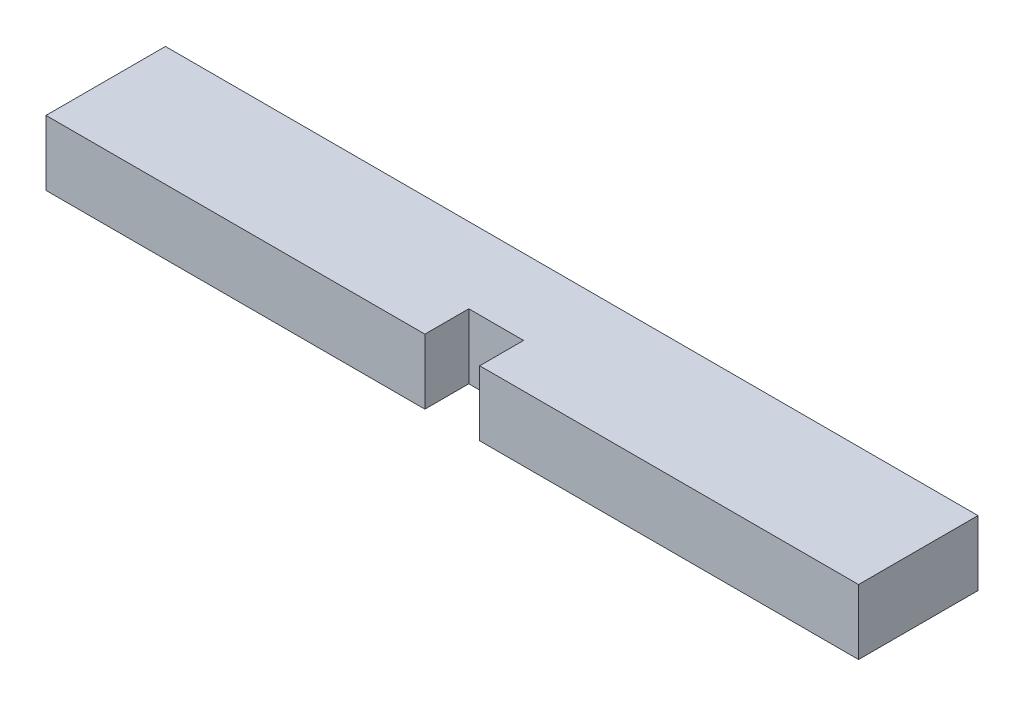
ISO-10303-21;
HEADER;
FILE_DESCRIPTION(('STEP AP214'),'2;1');
FILE_NAME('part.step','',(''),(''),'','','');
FILE_SCHEMA(('AUTOMOTIVE_DESIGN { 1 0 10303 214 1 1 1 1 }'));
ENDSEC;
DATA;
#1=APPLICATION_CONTEXT('core data for automotive mechanical design processes');
#2=APPLICATION_PROTOCOL_DEFINITION('international standard','automotive_design',2000,#1);
#3=PRODUCT_CONTEXT('',#1,'mechanical');
#4=PRODUCT('Part','Part','',(#3));
#5=PRODUCT_RELATED_PRODUCT_CATEGORY('part','',(#4));
#6=PRODUCT_DEFINITION_FORMATION('','',#4);
#7=PRODUCT_DEFINITION_CONTEXT('part definition',#1,'design');
#8=PRODUCT_DEFINITION('design','',#6,#7);
#9=PRODUCT_DEFINITION_SHAPE('','',#8);
#10=(LENGTH_UNIT() NAMED_UNIT(*) SI_UNIT(.MILLI.,.METRE.));
#11=(NAMED_UNIT(*) PLANE_ANGLE_UNIT() SI_UNIT($,.RADIAN.));
#12=(NAMED_UNIT(*) SI_UNIT($,.STERADIAN.) SOLID_ANGLE_UNIT());
#13=UNCERTAINTY_MEASURE_WITH_UNIT(LENGTH_MEASURE(1.E-05),#10,'distance_accuracy_value','');
#14=(GEOMETRIC_REPRESENTATION_CONTEXT(3) GLOBAL_UNCERTAINTY_ASSIGNED_CONTEXT((#13)) GLOBAL_UNIT_ASSIGNED_CONTEXT((#10,
#11,#12)) REPRESENTATION_CONTEXT('',''));
#15=CARTESIAN_POINT('',(0.,0.,0.));
#16=DIRECTION('',(0.,0.,1.));
#17=DIRECTION('',(1.,0.,0.));
#18=AXIS2_PLACEMENT_3D('',#15,#16,#17);
#19=CARTESIAN_POINT('',(-30.2574276062398,4.699,4.63286737044146));
#20=DIRECTION('',(0.,0.,-1.));
#21=DIRECTION('',(-1.,0.,0.));
#22=AXIS2_PLACEMENT_3D('',#19,#20,#21);
#23=PLANE('',#22);
#24=DIRECTION('',(0.,1.,0.));
#25=VECTOR('',#24,1.);
#26=CARTESIAN_POINT('',(1.09887239376018,4.699,4.63286737044146));
#27=LINE('',#26,#25);
#28=CARTESIAN_POINT('',(1.09887239376019,0.,4.63286737044146));
#29=VERTEX_POINT('',#28);
#30=CARTESIAN_POINT('',(1.09887239376019,4.699,4.63286737044146));
#31=VERTEX_POINT('',#30);
#32=EDGE_CURVE('E154',#29,#31,#27,.T.);
#33=ORIENTED_EDGE('',*,*,#32,.F.);
#34=DIRECTION('',(1.,0.,0.));
#35=VECTOR('',#34,1.);
#36=CARTESIAN_POINT('',(-30.2574276062398,0.,4.63286737044146));
#37=LINE('',#36,#35);
#38=CARTESIAN_POINT('',(28.4927723937602,0.,4.63286737044146));
#39=VERTEX_POINT('',#38);
#40=EDGE_CURVE('E141',#29,#39,#37,.T.);
#41=ORIENTED_EDGE('',*,*,#40,.T.);
#42=DIRECTION('',(0.,-1.,0.));
#43=VECTOR('',#42,1.);
#44=CARTESIAN_POINT('',(28.4927723937602,4.699,4.63286737044146));
#45=LINE('',#44,#43);
#46=CARTESIAN_POINT('',(28.4927723937602,4.699,4.63286737044146));
#47=VERTEX_POINT('',#46);
#48=EDGE_CURVE('E169',#47,#39,#45,.T.);
#49=ORIENTED_EDGE('',*,*,#48,.F.);
#50=DIRECTION('',(1.,0.,0.));
#51=VECTOR('',#50,1.);
#52=CARTESIAN_POINT('',(-30.2574276062398,4.699,4.63286737044146));
#53=LINE('',#52,#51);
#54=EDGE_CURVE('E192',#31,#47,#53,.T.);
#55=ORIENTED_EDGE('',*,*,#54,.F.);
#56=EDGE_LOOP('',(#33,#41,#49,#55));
#57=FACE_BOUND('',#56,.T.);
#58=ADVANCED_FACE('F45',(#57),#23,.F.);
#59=DIRECTION('',(0.,-1.,0.));
#60=VECTOR('',#59,1.);
#61=CARTESIAN_POINT('',(-2.86352760623981,4.69899999999999,4.63286737044146));
#62=LINE('',#61,#60);
#63=CARTESIAN_POINT('',(-2.86352760623981,4.699,4.63286737044146));
#64=VERTEX_POINT('',#63);
#65=CARTESIAN_POINT('',(-2.86352760623981,0.,4.63286737044146));
#66=VERTEX_POINT('',#65);
#67=EDGE_CURVE('E177',#64,#66,#62,.T.);
#68=ORIENTED_EDGE('',*,*,#67,.F.);
#69=CARTESIAN_POINT('',(-30.2574276062398,4.699,4.63286737044146));
#70=VERTEX_POINT('',#69);
#71=EDGE_CURVE('E99',#70,#64,#53,.T.);
#72=ORIENTED_EDGE('',*,*,#71,.F.);
#73=DIRECTION('',(0.,-1.,0.));
#74=VECTOR('',#73,1.);
#75=CARTESIAN_POINT('',(-30.2574276062398,4.699,4.63286737044146));
#76=LINE('',#75,#74);
#77=CARTESIAN_POINT('',(-30.2574276062398,0.,4.63286737044146));
#78=VERTEX_POINT('',#77);
#79=EDGE_CURVE('E172',#70,#78,#76,.T.);
#80=ORIENTED_EDGE('',*,*,#79,.T.);
#81=EDGE_CURVE('E147',#78,#66,#37,.T.);
#82=ORIENTED_EDGE('',*,*,#81,.T.);
#83=EDGE_LOOP('',(#68,#72,#80,#82));
#84=FACE_BOUND('',#83,.T.);
#85=ADVANCED_FACE('F179',(#84),#23,.F.);
#86=CARTESIAN_POINT('',(0.,4.699,0.));
#87=DIRECTION('',(0.,1.,0.));
#88=DIRECTION('',(0.,0.,1.));
#89=AXIS2_PLACEMENT_3D('',#86,#87,#88);
#90=PLANE('',#89);
#91=DIRECTION('',(-1.,0.,0.));
#92=VECTOR('',#91,1.);
#93=CARTESIAN_POINT('',(-2.86352760623981,4.699,1.45786737044146));
#94=LINE('',#93,#92);
#95=CARTESIAN_POINT('',(1.09887239376019,4.699,1.45786737044146));
#96=VERTEX_POINT('',#95);
#97=CARTESIAN_POINT('',(-2.86352760623981,4.699,1.45786737044146));
#98=VERTEX_POINT('',#97);
#99=EDGE_CURVE('E129',#96,#98,#94,.T.);
#100=ORIENTED_EDGE('',*,*,#99,.F.);
#101=DIRECTION('',(0.,0.,-1.));
#102=VECTOR('',#101,1.);
#103=CARTESIAN_POINT('',(1.09887239376019,4.699,4.63287937044146));
#104=LINE('',#103,#102);
#105=EDGE_CURVE('E126',#31,#96,#104,.T.);
#106=ORIENTED_EDGE('',*,*,#105,.F.);
#107=ORIENTED_EDGE('',*,*,#54,.T.);
#108=DIRECTION('',(0.,0.,-1.));
#109=VECTOR('',#108,1.);
#110=CARTESIAN_POINT('',(28.4927723937602,4.699,-4.00313262955854));
#111=LINE('',#110,#109);
#112=CARTESIAN_POINT('',(28.4927723937602,4.699,-4.00313262955854));
#113=VERTEX_POINT('',#112);
#114=EDGE_CURVE('E186',#47,#113,#111,.T.);
#115=ORIENTED_EDGE('',*,*,#114,.T.);
#116=DIRECTION('',(-1.,0.,0.));
#117=VECTOR('',#116,1.);
#118=CARTESIAN_POINT('',(-30.2574276062398,4.699,-4.00313262955854));
#119=LINE('',#118,#117);
#120=CARTESIAN_POINT('',(-30.2574276062398,4.699,-4.00313262955854));
#121=VERTEX_POINT('',#120);
#122=EDGE_CURVE('E70',#113,#121,#119,.T.);
#123=ORIENTED_EDGE('',*,*,#122,.T.);
#124=DIRECTION('',(0.,0.,1.));
#125=VECTOR('',#124,1.);
#126=CARTESIAN_POINT('',(-30.2574276062398,4.699,-4.00313262955854));
#127=LINE('',#126,#125);
#128=EDGE_CURVE('E162',#121,#70,#127,.T.);
#129=ORIENTED_EDGE('',*,*,#128,.T.);
#130=ORIENTED_EDGE('',*,*,#71,.T.);
#131=DIRECTION('',(0.,0.,-1.));
#132=VECTOR('',#131,1.);
#133=CARTESIAN_POINT('',(-2.86352760623981,4.699,4.63287937044146));
#134=LINE('',#133,#132);
#135=EDGE_CURVE('E201',#64,#98,#134,.T.);
#136=ORIENTED_EDGE('',*,*,#135,.T.);
#137=EDGE_LOOP('',(#100,#106,#107,#115,#123,#129,#130,#136));
#138=FACE_BOUND('',#137,.T.);
#139=ADVANCED_FACE('F208',(#138),#90,.T.);
#140=CARTESIAN_POINT('',(0.,0.,0.));
#141=DIRECTION('',(0.,1.,0.));
#142=DIRECTION('',(0.,0.,1.));
#143=AXIS2_PLACEMENT_3D('',#140,#141,#142);
#144=PLANE('',#143);
#145=DIRECTION('',(0.,0.,1.));
#146=VECTOR('',#145,1.);
#147=CARTESIAN_POINT('',(1.09887239376019,0.,0.));
#148=LINE('',#147,#146);
#149=CARTESIAN_POINT('',(1.09887239376019,0.,1.45786737044146));
#150=VERTEX_POINT('',#149);
#151=EDGE_CURVE('E11',#150,#29,#148,.T.);
#152=ORIENTED_EDGE('',*,*,#151,.F.);
#153=DIRECTION('',(1.,0.,0.));
#154=VECTOR('',#153,1.);
#155=CARTESIAN_POINT('',(1.09887239376019,0.,1.45786737044146));
#156=LINE('',#155,#154);
#157=CARTESIAN_POINT('',(-2.86352760623981,0.,1.45786737044146));
#158=VERTEX_POINT('',#157);
#159=EDGE_CURVE('E130',#158,#150,#156,.T.);
#160=ORIENTED_EDGE('',*,*,#159,.F.);
#161=DIRECTION('',(0.,0.,-1.));
#162=VECTOR('',#161,1.);
#163=CARTESIAN_POINT('',(-2.86352760623981,0.,0.));
#164=LINE('',#163,#162);
#165=EDGE_CURVE('E54',#66,#158,#164,.T.);
#166=ORIENTED_EDGE('',*,*,#165,.F.);
#167=ORIENTED_EDGE('',*,*,#81,.F.);
#168=DIRECTION('',(0.,0.,1.));
#169=VECTOR('',#168,1.);
#170=CARTESIAN_POINT('',(-30.2574276062398,0.,-4.00313262955854));
#171=LINE('',#170,#169);
#172=CARTESIAN_POINT('',(-30.2574276062398,0.,-4.00313262955854));
#173=VERTEX_POINT('',#172);
#174=EDGE_CURVE('E148',#173,#78,#171,.T.);
#175=ORIENTED_EDGE('',*,*,#174,.F.);
#176=DIRECTION('',(-1.,0.,0.));
#177=VECTOR('',#176,1.);
#178=CARTESIAN_POINT('',(-30.2574276062398,0.,-4.00313262955854));
#179=LINE('',#178,#177);
#180=CARTESIAN_POINT('',(28.4927723937602,0.,-4.00313262955854));
#181=VERTEX_POINT('',#180);
#182=EDGE_CURVE('E91',#181,#173,#179,.T.);
#183=ORIENTED_EDGE('',*,*,#182,.F.);
#184=DIRECTION('',(0.,0.,-1.));
#185=VECTOR('',#184,1.);
#186=CARTESIAN_POINT('',(28.4927723937602,0.,-4.00313262955854));
#187=LINE('',#186,#185);
#188=EDGE_CURVE('E142',#39,#181,#187,.T.);
#189=ORIENTED_EDGE('',*,*,#188,.F.);
#190=ORIENTED_EDGE('',*,*,#40,.F.);
#191=EDGE_LOOP('',(#152,#160,#166,#167,#175,#183,#189,#190));
#192=FACE_BOUND('',#191,.T.);
#193=ADVANCED_FACE('F139',(#192),#144,.F.);
#194=CARTESIAN_POINT('',(-30.2574276062398,4.699,-4.00313262955854));
#195=DIRECTION('',(1.,0.,0.));
#196=DIRECTION('',(0.,0.,-1.));
#197=AXIS2_PLACEMENT_3D('',#194,#195,#196);
#198=PLANE('',#197);
#199=ORIENTED_EDGE('',*,*,#174,.T.);
#200=ORIENTED_EDGE('',*,*,#79,.F.);
#201=ORIENTED_EDGE('',*,*,#128,.F.);
#202=DIRECTION('',(0.,-1.,0.));
#203=VECTOR('',#202,1.);
#204=CARTESIAN_POINT('',(-30.2574276062398,4.699,-4.00313262955854));
#205=LINE('',#204,#203);
#206=EDGE_CURVE('E163',#121,#173,#205,.T.);
#207=ORIENTED_EDGE('',*,*,#206,.T.);
#208=EDGE_LOOP('',(#199,#200,#201,#207));
#209=FACE_BOUND('',#208,.T.);
#210=ADVANCED_FACE('F47',(#209),#198,.F.);
#211=CARTESIAN_POINT('',(28.4927723937602,4.699,-4.00313262955854));
#212=DIRECTION('',(-1.,0.,0.));
#213=DIRECTION('',(0.,0.,1.));
#214=AXIS2_PLACEMENT_3D('',#211,#212,#213);
#215=PLANE('',#214);
#216=ORIENTED_EDGE('',*,*,#188,.T.);
#217=DIRECTION('',(0.,-1.,0.));
#218=VECTOR('',#217,1.);
#219=CARTESIAN_POINT('',(28.4927723937602,4.699,-4.00313262955854));
#220=LINE('',#219,#218);
#221=EDGE_CURVE('E166',#113,#181,#220,.T.);
#222=ORIENTED_EDGE('',*,*,#221,.F.);
#223=ORIENTED_EDGE('',*,*,#114,.F.);
#224=ORIENTED_EDGE('',*,*,#48,.T.);
#225=EDGE_LOOP('',(#216,#222,#223,#224));
#226=FACE_BOUND('',#225,.T.);
#227=ADVANCED_FACE('F222',(#226),#215,.F.);
#228=CARTESIAN_POINT('',(-30.2574276062398,4.699,-4.00313262955854));
#229=DIRECTION('',(0.,0.,1.));
#230=DIRECTION('',(1.,0.,0.));
#231=AXIS2_PLACEMENT_3D('',#228,#229,#230);
#232=PLANE('',#231);
#233=ORIENTED_EDGE('',*,*,#182,.T.);
#234=ORIENTED_EDGE('',*,*,#206,.F.);
#235=ORIENTED_EDGE('',*,*,#122,.F.);
#236=ORIENTED_EDGE('',*,*,#221,.T.);
#237=EDGE_LOOP('',(#233,#234,#235,#236));
#238=FACE_BOUND('',#237,.T.);
#239=ADVANCED_FACE('F183',(#238),#232,.F.);
#240=CARTESIAN_POINT('',(1.09887239376019,4.699,4.63287937044146));
#241=DIRECTION('',(-1.,0.,0.));
#242=DIRECTION('',(0.,-1.,0.));
#243=AXIS2_PLACEMENT_3D('',#240,#241,#242);
#244=PLANE('',#243);
#245=ORIENTED_EDGE('',*,*,#32,.T.);
#246=ORIENTED_EDGE('',*,*,#105,.T.);
#247=DIRECTION('',(0.,1.,0.));
#248=VECTOR('',#247,1.);
#249=CARTESIAN_POINT('',(1.09887239376019,4.699,1.45786737044146));
#250=LINE('',#249,#248);
#251=EDGE_CURVE('E121',#150,#96,#250,.T.);
#252=ORIENTED_EDGE('',*,*,#251,.F.);
#253=ORIENTED_EDGE('',*,*,#151,.T.);
#254=EDGE_LOOP('',(#245,#246,#252,#253));
#255=FACE_BOUND('',#254,.T.);
#256=ADVANCED_FACE('F122',(#255),#244,.T.);
#257=CARTESIAN_POINT('',(-2.86352760623981,0.,4.63287937044146));
#258=DIRECTION('',(1.,0.,0.));
#259=DIRECTION('',(0.,1.,0.));
#260=AXIS2_PLACEMENT_3D('',#257,#258,#259);
#261=PLANE('',#260);
#262=ORIENTED_EDGE('',*,*,#67,.T.);
#263=ORIENTED_EDGE('',*,*,#165,.T.);
#264=DIRECTION('',(0.,-1.,0.));
#265=VECTOR('',#264,1.);
#266=CARTESIAN_POINT('',(-2.86352760623981,0.,1.45786737044146));
#267=LINE('',#266,#265);
#268=EDGE_CURVE('E61',#98,#158,#267,.T.);
#269=ORIENTED_EDGE('',*,*,#268,.F.);
#270=ORIENTED_EDGE('',*,*,#135,.F.);
#271=EDGE_LOOP('',(#262,#263,#269,#270));
#272=FACE_BOUND('',#271,.T.);
#273=ADVANCED_FACE('F176',(#272),#261,.T.);
#274=CARTESIAN_POINT('',(0.,0.,1.45786737044146));
#275=DIRECTION('',(0.,0.,-1.));
#276=DIRECTION('',(-1.,0.,0.));
#277=AXIS2_PLACEMENT_3D('',#274,#275,#276);
#278=PLANE('',#277);
#279=ORIENTED_EDGE('',*,*,#159,.T.);
#280=ORIENTED_EDGE('',*,*,#251,.T.);
#281=ORIENTED_EDGE('',*,*,#99,.T.);
#282=ORIENTED_EDGE('',*,*,#268,.T.);
#283=EDGE_LOOP('',(#279,#280,#281,#282));
#284=FACE_BOUND('',#283,.T.);
#285=ADVANCED_FACE('F133',(#284),#278,.F.);
#286=CLOSED_SHELL('',(#58,#85,#139,#193,#210,#227,#239,#256,#273,#285));
#287=MANIFOLD_SOLID_BREP('B2',#286);
#288=ADVANCED_BREP_SHAPE_REPRESENTATION('',(#18,#287),#14);
#289=SHAPE_DEFINITION_REPRESENTATION(#9,#288);
ENDSEC;
END-ISO-10303-21;
